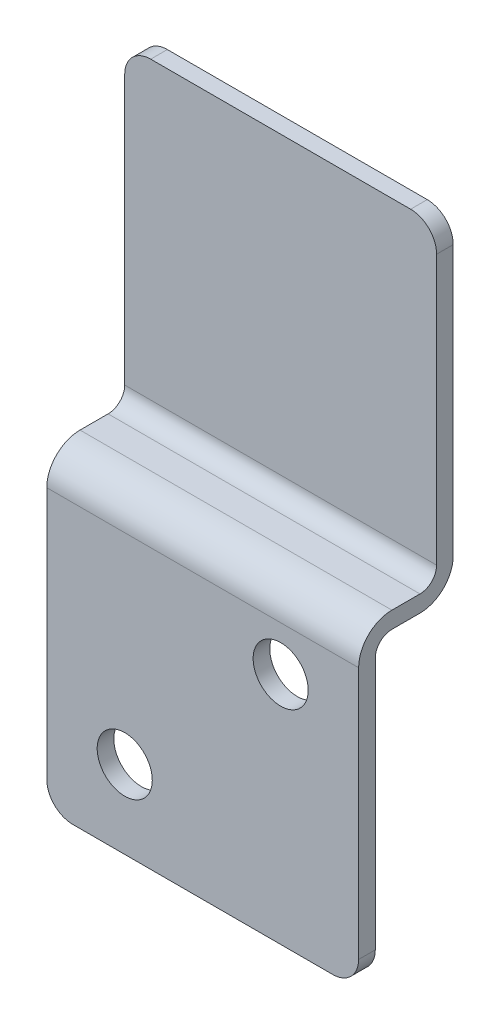
ISO-10303-21;
HEADER;
FILE_DESCRIPTION(('STEP AP214'),'2;1');
FILE_NAME('part.step','',(''),(''),'','','');
FILE_SCHEMA(('AUTOMOTIVE_DESIGN { 1 0 10303 214 1 1 1 1 }'));
ENDSEC;
DATA;
#1=APPLICATION_CONTEXT('core data for automotive mechanical design processes');
#2=APPLICATION_PROTOCOL_DEFINITION('international standard','automotive_design',2000,#1);
#3=PRODUCT_CONTEXT('',#1,'mechanical');
#4=PRODUCT('Part','Part','',(#3));
#5=PRODUCT_RELATED_PRODUCT_CATEGORY('part','',(#4));
#6=PRODUCT_DEFINITION_FORMATION('','',#4);
#7=PRODUCT_DEFINITION_CONTEXT('part definition',#1,'design');
#8=PRODUCT_DEFINITION('design','',#6,#7);
#9=PRODUCT_DEFINITION_SHAPE('','',#8);
#10=(LENGTH_UNIT() NAMED_UNIT(*) SI_UNIT(.MILLI.,.METRE.));
#11=(NAMED_UNIT(*) PLANE_ANGLE_UNIT() SI_UNIT($,.RADIAN.));
#12=(NAMED_UNIT(*) SI_UNIT($,.STERADIAN.) SOLID_ANGLE_UNIT());
#13=UNCERTAINTY_MEASURE_WITH_UNIT(LENGTH_MEASURE(1.E-05),#10,'distance_accuracy_value','');
#14=(GEOMETRIC_REPRESENTATION_CONTEXT(3) GLOBAL_UNCERTAINTY_ASSIGNED_CONTEXT((#13)) GLOBAL_UNIT_ASSIGNED_CONTEXT((#10,
#11,#12)) REPRESENTATION_CONTEXT('',''));
#15=CARTESIAN_POINT('',(0.,0.,0.));
#16=DIRECTION('',(0.,0.,1.));
#17=DIRECTION('',(1.,0.,0.));
#18=AXIS2_PLACEMENT_3D('',#15,#16,#17);
#19=CARTESIAN_POINT('',(38.1,0.,0.));
#20=DIRECTION('',(0.,-1.,0.));
#21=DIRECTION('',(0.,0.,-1.));
#22=AXIS2_PLACEMENT_3D('',#19,#20,#21);
#23=PLANE('',#22);
#24=DIRECTION('',(-1.,0.,0.));
#25=VECTOR('',#24,1.);
#26=CARTESIAN_POINT('',(38.1,0.,-2.032));
#27=LINE('',#26,#25);
#28=CARTESIAN_POINT('',(34.925,0.,-2.032));
#29=VERTEX_POINT('',#28);
#30=CARTESIAN_POINT('',(3.17500000000001,0.,-2.032));
#31=VERTEX_POINT('',#30);
#32=EDGE_CURVE('E188',#29,#31,#27,.T.);
#33=ORIENTED_EDGE('',*,*,#32,.T.);
#34=DIRECTION('',(0.,0.,1.));
#35=VECTOR('',#34,1.);
#36=CARTESIAN_POINT('',(3.175,0.,0.));
#37=LINE('',#36,#35);
#38=CARTESIAN_POINT('',(3.17500000000001,0.,0.));
#39=VERTEX_POINT('',#38);
#40=EDGE_CURVE('E248',#31,#39,#37,.T.);
#41=ORIENTED_EDGE('',*,*,#40,.T.);
#42=DIRECTION('',(-1.,0.,0.));
#43=VECTOR('',#42,1.);
#44=CARTESIAN_POINT('',(38.1,0.,0.));
#45=LINE('',#44,#43);
#46=CARTESIAN_POINT('',(34.925,0.,0.));
#47=VERTEX_POINT('',#46);
#48=EDGE_CURVE('E173',#47,#39,#45,.T.);
#49=ORIENTED_EDGE('',*,*,#48,.F.);
#50=DIRECTION('',(0.,0.,1.));
#51=VECTOR('',#50,1.);
#52=CARTESIAN_POINT('',(34.925,0.,0.));
#53=LINE('',#52,#51);
#54=EDGE_CURVE('E246',#47,#29,#53,.F.);
#55=ORIENTED_EDGE('',*,*,#54,.T.);
#56=EDGE_LOOP('',(#33,#41,#49,#55));
#57=FACE_BOUND('',#56,.T.);
#58=ADVANCED_FACE('F33',(#57),#23,.F.);
#59=CARTESIAN_POINT('',(38.1,0.,0.));
#60=DIRECTION('',(0.,0.,-1.));
#61=DIRECTION('',(0.,1.,0.));
#62=AXIS2_PLACEMENT_3D('',#59,#60,#61);
#63=PLANE('',#62);
#64=ORIENTED_EDGE('',*,*,#48,.T.);
#65=CARTESIAN_POINT('',(3.175,-3.175,0.));
#66=DIRECTION('',(0.,0.,-1.));
#67=DIRECTION('',(0.,1.,0.));
#68=AXIS2_PLACEMENT_3D('',#65,#66,#67);
#69=CIRCLE('',#68,3.175);
#70=CARTESIAN_POINT('',(0.,-3.175,0.));
#71=VERTEX_POINT('',#70);
#72=EDGE_CURVE('E252',#39,#71,#69,.F.);
#73=ORIENTED_EDGE('',*,*,#72,.T.);
#74=DIRECTION('',(0.,-1.,0.));
#75=VECTOR('',#74,1.);
#76=CARTESIAN_POINT('',(0.,0.,0.));
#77=LINE('',#76,#75);
#78=CARTESIAN_POINT('',(0.,-36.068,0.));
#79=VERTEX_POINT('',#78);
#80=EDGE_CURVE('E263',#71,#79,#77,.T.);
#81=ORIENTED_EDGE('',*,*,#80,.T.);
#82=DIRECTION('',(-1.,0.,0.));
#83=VECTOR('',#82,1.);
#84=CARTESIAN_POINT('',(38.1,-36.068,0.));
#85=LINE('',#84,#83);
#86=CARTESIAN_POINT('',(38.1,-36.068,0.));
#87=VERTEX_POINT('',#86);
#88=EDGE_CURVE('E163',#79,#87,#85,.F.);
#89=ORIENTED_EDGE('',*,*,#88,.T.);
#90=DIRECTION('',(0.,-1.,0.));
#91=VECTOR('',#90,1.);
#92=CARTESIAN_POINT('',(38.1,0.,0.));
#93=LINE('',#92,#91);
#94=CARTESIAN_POINT('',(38.1,-3.175,0.));
#95=VERTEX_POINT('',#94);
#96=EDGE_CURVE('E182',#95,#87,#93,.T.);
#97=ORIENTED_EDGE('',*,*,#96,.F.);
#98=CARTESIAN_POINT('',(34.925,-3.175,0.));
#99=DIRECTION('',(0.,0.,-1.));
#100=DIRECTION('',(0.,1.,0.));
#101=AXIS2_PLACEMENT_3D('',#98,#99,#100);
#102=CIRCLE('',#101,3.175);
#103=EDGE_CURVE('E58',#95,#47,#102,.F.);
#104=ORIENTED_EDGE('',*,*,#103,.T.);
#105=EDGE_LOOP('',(#64,#73,#81,#89,#97,#104));
#106=FACE_BOUND('',#105,.T.);
#107=ADVANCED_FACE('F335',(#106),#63,.F.);
#108=CARTESIAN_POINT('',(38.1,-38.1,0.));
#109=DIRECTION('',(0.,-1.,0.));
#110=DIRECTION('',(0.,0.,-1.));
#111=AXIS2_PLACEMENT_3D('',#108,#109,#110);
#112=PLANE('',#111);
#113=DIRECTION('',(0.,0.,1.));
#114=VECTOR('',#113,1.);
#115=CARTESIAN_POINT('',(0.,-38.1,0.));
#116=LINE('',#115,#114);
#117=CARTESIAN_POINT('',(0.,-38.1,2.032));
#118=VERTEX_POINT('',#117);
#119=CARTESIAN_POINT('',(0.,-38.1,5.461));
#120=VERTEX_POINT('',#119);
#121=EDGE_CURVE('E284',#118,#120,#116,.T.);
#122=ORIENTED_EDGE('',*,*,#121,.T.);
#123=DIRECTION('',(-1.,0.,0.));
#124=VECTOR('',#123,1.);
#125=CARTESIAN_POINT('',(38.1,-38.1,5.461));
#126=LINE('',#125,#124);
#127=CARTESIAN_POINT('',(38.1,-38.1,5.461));
#128=VERTEX_POINT('',#127);
#129=EDGE_CURVE('E218',#120,#128,#126,.F.);
#130=ORIENTED_EDGE('',*,*,#129,.T.);
#131=DIRECTION('',(0.,0.,1.));
#132=VECTOR('',#131,1.);
#133=CARTESIAN_POINT('',(38.1,-38.1,0.));
#134=LINE('',#133,#132);
#135=CARTESIAN_POINT('',(38.1,-38.1,2.032));
#136=VERTEX_POINT('',#135);
#137=EDGE_CURVE('E273',#136,#128,#134,.T.);
#138=ORIENTED_EDGE('',*,*,#137,.F.);
#139=DIRECTION('',(-1.,0.,0.));
#140=VECTOR('',#139,1.);
#141=CARTESIAN_POINT('',(0.,-38.1,2.032));
#142=LINE('',#141,#140);
#143=EDGE_CURVE('E201',#136,#118,#142,.T.);
#144=ORIENTED_EDGE('',*,*,#143,.T.);
#145=EDGE_LOOP('',(#122,#130,#138,#144));
#146=FACE_BOUND('',#145,.T.);
#147=ADVANCED_FACE('F317',(#146),#112,.F.);
#148=CARTESIAN_POINT('',(38.1,-38.1,9.525));
#149=DIRECTION('',(0.,0.,-1.));
#150=DIRECTION('',(0.,1.,0.));
#151=AXIS2_PLACEMENT_3D('',#148,#149,#150);
#152=PLANE('',#151);
#153=CARTESIAN_POINT('',(9.525,-66.675,9.52500000000001));
#154=DIRECTION('',(0.,0.,1.));
#155=DIRECTION('',(1.,0.,0.));
#156=AXIS2_PLACEMENT_3D('',#153,#154,#155);
#157=CIRCLE('',#156,3.3655);
#158=CARTESIAN_POINT('',(12.8905,-66.675,9.52500000000001));
#159=VERTEX_POINT('',#158);
#160=EDGE_CURVE('E259',#159,#159,#157,.T.);
#161=ORIENTED_EDGE('',*,*,#160,.F.);
#162=EDGE_LOOP('',(#161));
#163=FACE_BOUND('',#162,.T.);
#164=CARTESIAN_POINT('',(28.575,-47.625,9.52500000000001));
#165=DIRECTION('',(0.,0.,1.));
#166=DIRECTION('',(1.,0.,0.));
#167=AXIS2_PLACEMENT_3D('',#164,#165,#166);
#168=CIRCLE('',#167,3.36549999999999);
#169=CARTESIAN_POINT('',(31.9405,-47.625,9.52500000000001));
#170=VERTEX_POINT('',#169);
#171=EDGE_CURVE('E265',#170,#170,#168,.T.);
#172=ORIENTED_EDGE('',*,*,#171,.F.);
#173=EDGE_LOOP('',(#172));
#174=FACE_BOUND('',#173,.T.);
#175=DIRECTION('',(0.,-1.,0.));
#176=VECTOR('',#175,1.);
#177=CARTESIAN_POINT('',(0.,-38.1,9.525));
#178=LINE('',#177,#176);
#179=CARTESIAN_POINT('',(0.,-42.164,9.525));
#180=VERTEX_POINT('',#179);
#181=CARTESIAN_POINT('',(0.,-73.025,9.52499999999999));
#182=VERTEX_POINT('',#181);
#183=EDGE_CURVE('E184',#180,#182,#178,.T.);
#184=ORIENTED_EDGE('',*,*,#183,.T.);
#185=CARTESIAN_POINT('',(3.175,-73.025,9.52499999999999));
#186=DIRECTION('',(0.,0.,-1.));
#187=DIRECTION('',(0.,1.,0.));
#188=AXIS2_PLACEMENT_3D('',#185,#186,#187);
#189=CIRCLE('',#188,3.175);
#190=CARTESIAN_POINT('',(3.17500000000001,-76.2,9.52499999999999));
#191=VERTEX_POINT('',#190);
#192=EDGE_CURVE('E244',#182,#191,#189,.F.);
#193=ORIENTED_EDGE('',*,*,#192,.T.);
#194=DIRECTION('',(-1.,0.,0.));
#195=VECTOR('',#194,1.);
#196=CARTESIAN_POINT('',(38.1,-76.2,9.52499999999999));
#197=LINE('',#196,#195);
#198=CARTESIAN_POINT('',(34.925,-76.2,9.52499999999999));
#199=VERTEX_POINT('',#198);
#200=EDGE_CURVE('E195',#199,#191,#197,.T.);
#201=ORIENTED_EDGE('',*,*,#200,.F.);
#202=CARTESIAN_POINT('',(34.925,-73.025,9.52499999999999));
#203=DIRECTION('',(0.,0.,-1.));
#204=DIRECTION('',(0.,1.,0.));
#205=AXIS2_PLACEMENT_3D('',#202,#203,#204);
#206=CIRCLE('',#205,3.175);
#207=CARTESIAN_POINT('',(38.1,-73.025,9.52499999999999));
#208=VERTEX_POINT('',#207);
#209=EDGE_CURVE('E242',#199,#208,#206,.F.);
#210=ORIENTED_EDGE('',*,*,#209,.T.);
#211=DIRECTION('',(0.,-1.,0.));
#212=VECTOR('',#211,1.);
#213=CARTESIAN_POINT('',(38.1,-38.1,9.525));
#214=LINE('',#213,#212);
#215=CARTESIAN_POINT('',(38.1,-42.164,9.525));
#216=VERTEX_POINT('',#215);
#217=EDGE_CURVE('E276',#216,#208,#214,.T.);
#218=ORIENTED_EDGE('',*,*,#217,.F.);
#219=DIRECTION('',(-1.,0.,0.));
#220=VECTOR('',#219,1.);
#221=CARTESIAN_POINT('',(38.1,-42.164,9.525));
#222=LINE('',#221,#220);
#223=EDGE_CURVE('E212',#216,#180,#222,.T.);
#224=ORIENTED_EDGE('',*,*,#223,.T.);
#225=EDGE_LOOP('',(#184,#193,#201,#210,#218,#224));
#226=FACE_BOUND('',#225,.T.);
#227=ADVANCED_FACE('F290',(#163,#174,#226),#152,.F.);
#228=CARTESIAN_POINT('',(38.1,-76.2,9.52499999999999));
#229=DIRECTION('',(0.,1.,0.));
#230=DIRECTION('',(0.,0.,1.));
#231=AXIS2_PLACEMENT_3D('',#228,#229,#230);
#232=PLANE('',#231);
#233=ORIENTED_EDGE('',*,*,#200,.T.);
#234=DIRECTION('',(0.,0.,-1.));
#235=VECTOR('',#234,1.);
#236=CARTESIAN_POINT('',(3.175,-76.2,7.49299999999999));
#237=LINE('',#236,#235);
#238=CARTESIAN_POINT('',(3.17500000000001,-76.2,7.49299999999999));
#239=VERTEX_POINT('',#238);
#240=EDGE_CURVE('E231',#191,#239,#237,.T.);
#241=ORIENTED_EDGE('',*,*,#240,.T.);
#242=DIRECTION('',(-1.,0.,0.));
#243=VECTOR('',#242,1.);
#244=CARTESIAN_POINT('',(38.1,-76.2,7.49299999999999));
#245=LINE('',#244,#243);
#246=CARTESIAN_POINT('',(34.925,-76.2,7.49299999999999));
#247=VERTEX_POINT('',#246);
#248=EDGE_CURVE('E191',#247,#239,#245,.T.);
#249=ORIENTED_EDGE('',*,*,#248,.F.);
#250=DIRECTION('',(0.,0.,-1.));
#251=VECTOR('',#250,1.);
#252=CARTESIAN_POINT('',(34.925,-76.2,9.52499999999999));
#253=LINE('',#252,#251);
#254=EDGE_CURVE('E229',#247,#199,#253,.F.);
#255=ORIENTED_EDGE('',*,*,#254,.T.);
#256=EDGE_LOOP('',(#233,#241,#249,#255));
#257=FACE_BOUND('',#256,.T.);
#258=ADVANCED_FACE('F300',(#257),#232,.F.);
#259=CARTESIAN_POINT('',(38.1,-40.132,7.493));
#260=DIRECTION('',(0.,0.,1.));
#261=DIRECTION('',(0.,-1.,0.));
#262=AXIS2_PLACEMENT_3D('',#259,#260,#261);
#263=PLANE('',#262);
#264=CARTESIAN_POINT('',(9.525,-66.675,7.49299999999999));
#265=DIRECTION('',(0.,0.,1.));
#266=DIRECTION('',(0.,-1.,0.));
#267=AXIS2_PLACEMENT_3D('',#264,#265,#266);
#268=CIRCLE('',#267,3.3655);
#269=CARTESIAN_POINT('',(9.525,-70.0405,7.49299999999999));
#270=VERTEX_POINT('',#269);
#271=EDGE_CURVE('E37',#270,#270,#268,.T.);
#272=ORIENTED_EDGE('',*,*,#271,.T.);
#273=EDGE_LOOP('',(#272));
#274=FACE_BOUND('',#273,.T.);
#275=CARTESIAN_POINT('',(28.575,-47.625,7.493));
#276=DIRECTION('',(0.,0.,1.));
#277=DIRECTION('',(0.,-1.,0.));
#278=AXIS2_PLACEMENT_3D('',#275,#276,#277);
#279=CIRCLE('',#278,3.36549999999999);
#280=CARTESIAN_POINT('',(28.575,-50.9905,7.493));
#281=VERTEX_POINT('',#280);
#282=EDGE_CURVE('E257',#281,#281,#279,.T.);
#283=ORIENTED_EDGE('',*,*,#282,.T.);
#284=EDGE_LOOP('',(#283));
#285=FACE_BOUND('',#284,.T.);
#286=ORIENTED_EDGE('',*,*,#248,.T.);
#287=CARTESIAN_POINT('',(3.175,-73.025,7.49299999999999));
#288=DIRECTION('',(0.,0.,1.));
#289=DIRECTION('',(0.,-1.,0.));
#290=AXIS2_PLACEMENT_3D('',#287,#288,#289);
#291=CIRCLE('',#290,3.175);
#292=CARTESIAN_POINT('',(0.,-73.025,7.49299999999999));
#293=VERTEX_POINT('',#292);
#294=EDGE_CURVE('E236',#239,#293,#291,.F.);
#295=ORIENTED_EDGE('',*,*,#294,.T.);
#296=DIRECTION('',(0.,1.,0.));
#297=VECTOR('',#296,1.);
#298=CARTESIAN_POINT('',(0.,-40.132,7.493));
#299=LINE('',#298,#297);
#300=CARTESIAN_POINT('',(0.,-42.164,7.493));
#301=VERTEX_POINT('',#300);
#302=EDGE_CURVE('E179',#293,#301,#299,.T.);
#303=ORIENTED_EDGE('',*,*,#302,.T.);
#304=DIRECTION('',(-1.,0.,0.));
#305=VECTOR('',#304,1.);
#306=CARTESIAN_POINT('',(38.1,-42.164,7.493));
#307=LINE('',#306,#305);
#308=CARTESIAN_POINT('',(38.1,-42.164,7.493));
#309=VERTEX_POINT('',#308);
#310=EDGE_CURVE('E158',#301,#309,#307,.F.);
#311=ORIENTED_EDGE('',*,*,#310,.T.);
#312=DIRECTION('',(0.,1.,0.));
#313=VECTOR('',#312,1.);
#314=CARTESIAN_POINT('',(38.1,-40.132,7.493));
#315=LINE('',#314,#313);
#316=CARTESIAN_POINT('',(38.1,-73.025,7.49299999999999));
#317=VERTEX_POINT('',#316);
#318=EDGE_CURVE('E279',#317,#309,#315,.T.);
#319=ORIENTED_EDGE('',*,*,#318,.F.);
#320=CARTESIAN_POINT('',(34.925,-73.025,7.49299999999999));
#321=DIRECTION('',(0.,0.,1.));
#322=DIRECTION('',(0.,-1.,0.));
#323=AXIS2_PLACEMENT_3D('',#320,#321,#322);
#324=CIRCLE('',#323,3.175);
#325=EDGE_CURVE('E234',#317,#247,#324,.F.);
#326=ORIENTED_EDGE('',*,*,#325,.T.);
#327=EDGE_LOOP('',(#286,#295,#303,#311,#319,#326));
#328=FACE_BOUND('',#327,.T.);
#329=ADVANCED_FACE('F303',(#274,#285,#328),#263,.F.);
#330=CARTESIAN_POINT('',(38.1,-40.132,-2.032));
#331=DIRECTION('',(0.,1.,0.));
#332=DIRECTION('',(0.,0.,1.));
#333=AXIS2_PLACEMENT_3D('',#330,#331,#332);
#334=PLANE('',#333);
#335=DIRECTION('',(0.,0.,-1.));
#336=VECTOR('',#335,1.);
#337=CARTESIAN_POINT('',(0.,-40.132,-2.032));
#338=LINE('',#337,#336);
#339=CARTESIAN_POINT('',(0.,-40.132,5.461));
#340=VERTEX_POINT('',#339);
#341=CARTESIAN_POINT('',(0.,-40.132,2.032));
#342=VERTEX_POINT('',#341);
#343=EDGE_CURVE('E169',#340,#342,#338,.T.);
#344=ORIENTED_EDGE('',*,*,#343,.T.);
#345=DIRECTION('',(-1.,0.,0.));
#346=VECTOR('',#345,1.);
#347=CARTESIAN_POINT('',(38.1,-40.132,2.032));
#348=LINE('',#347,#346);
#349=CARTESIAN_POINT('',(38.1,-40.132,2.032));
#350=VERTEX_POINT('',#349);
#351=EDGE_CURVE('E227',#342,#350,#348,.F.);
#352=ORIENTED_EDGE('',*,*,#351,.T.);
#353=DIRECTION('',(0.,0.,-1.));
#354=VECTOR('',#353,1.);
#355=CARTESIAN_POINT('',(38.1,-40.132,-2.032));
#356=LINE('',#355,#354);
#357=CARTESIAN_POINT('',(38.1,-40.132,5.461));
#358=VERTEX_POINT('',#357);
#359=EDGE_CURVE('E172',#358,#350,#356,.T.);
#360=ORIENTED_EDGE('',*,*,#359,.F.);
#361=DIRECTION('',(-1.,0.,0.));
#362=VECTOR('',#361,1.);
#363=CARTESIAN_POINT('',(0.,-40.132,5.461));
#364=LINE('',#363,#362);
#365=EDGE_CURVE('E156',#358,#340,#364,.T.);
#366=ORIENTED_EDGE('',*,*,#365,.T.);
#367=EDGE_LOOP('',(#344,#352,#360,#366));
#368=FACE_BOUND('',#367,.T.);
#369=ADVANCED_FACE('F168',(#368),#334,.F.);
#370=CARTESIAN_POINT('',(38.1,0.,-2.032));
#371=DIRECTION('',(0.,0.,1.));
#372=DIRECTION('',(0.,-1.,0.));
#373=AXIS2_PLACEMENT_3D('',#370,#371,#372);
#374=PLANE('',#373);
#375=DIRECTION('',(0.,1.,0.));
#376=VECTOR('',#375,1.);
#377=CARTESIAN_POINT('',(0.,0.,-2.032));
#378=LINE('',#377,#376);
#379=CARTESIAN_POINT('',(0.,-36.068,-2.032));
#380=VERTEX_POINT('',#379);
#381=CARTESIAN_POINT('',(0.,-3.175,-2.032));
#382=VERTEX_POINT('',#381);
#383=EDGE_CURVE('E178',#380,#382,#378,.T.);
#384=ORIENTED_EDGE('',*,*,#383,.T.);
#385=CARTESIAN_POINT('',(3.175,-3.175,-2.032));
#386=DIRECTION('',(0.,0.,1.));
#387=DIRECTION('',(0.,-1.,0.));
#388=AXIS2_PLACEMENT_3D('',#385,#386,#387);
#389=CIRCLE('',#388,3.175);
#390=EDGE_CURVE('E255',#382,#31,#389,.F.);
#391=ORIENTED_EDGE('',*,*,#390,.T.);
#392=ORIENTED_EDGE('',*,*,#32,.F.);
#393=CARTESIAN_POINT('',(34.925,-3.175,-2.032));
#394=DIRECTION('',(0.,0.,1.));
#395=DIRECTION('',(0.,-1.,0.));
#396=AXIS2_PLACEMENT_3D('',#393,#394,#395);
#397=CIRCLE('',#396,3.175);
#398=CARTESIAN_POINT('',(38.1,-3.175,-2.032));
#399=VERTEX_POINT('',#398);
#400=EDGE_CURVE('E50',#29,#399,#397,.F.);
#401=ORIENTED_EDGE('',*,*,#400,.T.);
#402=DIRECTION('',(0.,1.,0.));
#403=VECTOR('',#402,1.);
#404=CARTESIAN_POINT('',(38.1,0.,-2.032));
#405=LINE('',#404,#403);
#406=CARTESIAN_POINT('',(38.1,-36.068,-2.032));
#407=VERTEX_POINT('',#406);
#408=EDGE_CURVE('E192',#407,#399,#405,.T.);
#409=ORIENTED_EDGE('',*,*,#408,.F.);
#410=DIRECTION('',(-1.,0.,0.));
#411=VECTOR('',#410,1.);
#412=CARTESIAN_POINT('',(38.1,-36.068,-2.032));
#413=LINE('',#412,#411);
#414=EDGE_CURVE('E224',#407,#380,#413,.T.);
#415=ORIENTED_EDGE('',*,*,#414,.T.);
#416=EDGE_LOOP('',(#384,#391,#392,#401,#409,#415));
#417=FACE_BOUND('',#416,.T.);
#418=ADVANCED_FACE('F331',(#417),#374,.F.);
#419=CARTESIAN_POINT('',(38.1,0.,0.));
#420=DIRECTION('',(-1.,0.,0.));
#421=DIRECTION('',(0.,0.,1.));
#422=AXIS2_PLACEMENT_3D('',#419,#420,#421);
#423=PLANE('',#422);
#424=ORIENTED_EDGE('',*,*,#217,.T.);
#425=DIRECTION('',(0.,0.,-1.));
#426=VECTOR('',#425,1.);
#427=CARTESIAN_POINT('',(38.1,-73.025,0.));
#428=LINE('',#427,#426);
#429=EDGE_CURVE('E11',#208,#317,#428,.T.);
#430=ORIENTED_EDGE('',*,*,#429,.T.);
#431=ORIENTED_EDGE('',*,*,#318,.T.);
#432=CARTESIAN_POINT('',(38.1,-42.164,5.461));
#433=DIRECTION('',(-1.,0.,0.));
#434=DIRECTION('',(0.,0.,1.));
#435=AXIS2_PLACEMENT_3D('',#432,#433,#434);
#436=CIRCLE('',#435,2.032);
#437=EDGE_CURVE('E162',#309,#358,#436,.T.);
#438=ORIENTED_EDGE('',*,*,#437,.T.);
#439=ORIENTED_EDGE('',*,*,#359,.T.);
#440=CARTESIAN_POINT('',(38.1,-36.068,2.03199999999999));
#441=DIRECTION('',(-1.,0.,0.));
#442=DIRECTION('',(0.,0.,1.));
#443=AXIS2_PLACEMENT_3D('',#440,#441,#442);
#444=CIRCLE('',#443,4.064);
#445=EDGE_CURVE('E220',#350,#407,#444,.F.);
#446=ORIENTED_EDGE('',*,*,#445,.T.);
#447=ORIENTED_EDGE('',*,*,#408,.T.);
#448=DIRECTION('',(0.,0.,1.));
#449=VECTOR('',#448,1.);
#450=CARTESIAN_POINT('',(38.1,-3.175,0.));
#451=LINE('',#450,#449);
#452=EDGE_CURVE('E42',#399,#95,#451,.T.);
#453=ORIENTED_EDGE('',*,*,#452,.T.);
#454=ORIENTED_EDGE('',*,*,#96,.T.);
#455=CARTESIAN_POINT('',(38.1,-36.068,2.032));
#456=DIRECTION('',(-1.,0.,0.));
#457=DIRECTION('',(0.,0.,1.));
#458=AXIS2_PLACEMENT_3D('',#455,#456,#457);
#459=CIRCLE('',#458,2.032);
#460=EDGE_CURVE('E210',#87,#136,#459,.T.);
#461=ORIENTED_EDGE('',*,*,#460,.T.);
#462=ORIENTED_EDGE('',*,*,#137,.T.);
#463=CARTESIAN_POINT('',(38.1,-42.164,5.461));
#464=DIRECTION('',(-1.,0.,0.));
#465=DIRECTION('',(0.,0.,1.));
#466=AXIS2_PLACEMENT_3D('',#463,#464,#465);
#467=CIRCLE('',#466,4.064);
#468=EDGE_CURVE('E222',#128,#216,#467,.F.);
#469=ORIENTED_EDGE('',*,*,#468,.T.);
#470=EDGE_LOOP('',(#424,#430,#431,#438,#439,#446,#447,#453,#454,#461,#462,#469));
#471=FACE_BOUND('',#470,.T.);
#472=ADVANCED_FACE('F310',(#471),#423,.F.);
#473=CARTESIAN_POINT('',(0.,0.,0.));
#474=DIRECTION('',(-1.,0.,0.));
#475=DIRECTION('',(0.,0.,1.));
#476=AXIS2_PLACEMENT_3D('',#473,#474,#475);
#477=PLANE('',#476);
#478=ORIENTED_EDGE('',*,*,#302,.F.);
#479=DIRECTION('',(0.,0.,-1.));
#480=VECTOR('',#479,1.);
#481=CARTESIAN_POINT('',(0.,-73.025,9.52499999999999));
#482=LINE('',#481,#480);
#483=EDGE_CURVE('E240',#293,#182,#482,.F.);
#484=ORIENTED_EDGE('',*,*,#483,.T.);
#485=ORIENTED_EDGE('',*,*,#183,.F.);
#486=CARTESIAN_POINT('',(0.,-42.164,5.461));
#487=DIRECTION('',(-1.,0.,0.));
#488=DIRECTION('',(0.,0.,1.));
#489=AXIS2_PLACEMENT_3D('',#486,#487,#488);
#490=CIRCLE('',#489,4.064);
#491=EDGE_CURVE('E216',#180,#120,#490,.T.);
#492=ORIENTED_EDGE('',*,*,#491,.T.);
#493=ORIENTED_EDGE('',*,*,#121,.F.);
#494=CARTESIAN_POINT('',(0.,-36.068,2.032));
#495=DIRECTION('',(-1.,0.,0.));
#496=DIRECTION('',(0.,0.,1.));
#497=AXIS2_PLACEMENT_3D('',#494,#495,#496);
#498=CIRCLE('',#497,2.032);
#499=EDGE_CURVE('E207',#118,#79,#498,.F.);
#500=ORIENTED_EDGE('',*,*,#499,.T.);
#501=ORIENTED_EDGE('',*,*,#80,.F.);
#502=DIRECTION('',(0.,0.,1.));
#503=VECTOR('',#502,1.);
#504=CARTESIAN_POINT('',(0.,-3.175,-2.032));
#505=LINE('',#504,#503);
#506=EDGE_CURVE('E238',#71,#382,#505,.F.);
#507=ORIENTED_EDGE('',*,*,#506,.T.);
#508=ORIENTED_EDGE('',*,*,#383,.F.);
#509=CARTESIAN_POINT('',(0.,-36.068,2.03199999999999));
#510=DIRECTION('',(-1.,0.,0.));
#511=DIRECTION('',(0.,0.,1.));
#512=AXIS2_PLACEMENT_3D('',#509,#510,#511);
#513=CIRCLE('',#512,4.064);
#514=EDGE_CURVE('E177',#380,#342,#513,.T.);
#515=ORIENTED_EDGE('',*,*,#514,.T.);
#516=ORIENTED_EDGE('',*,*,#343,.F.);
#517=CARTESIAN_POINT('',(0.,-42.164,5.461));
#518=DIRECTION('',(-1.,0.,0.));
#519=DIRECTION('',(0.,0.,1.));
#520=AXIS2_PLACEMENT_3D('',#517,#518,#519);
#521=CIRCLE('',#520,2.032);
#522=EDGE_CURVE('E152',#340,#301,#521,.F.);
#523=ORIENTED_EDGE('',*,*,#522,.T.);
#524=EDGE_LOOP('',(#478,#484,#485,#492,#493,#500,#501,#507,#508,#515,#516,#523));
#525=FACE_BOUND('',#524,.T.);
#526=ADVANCED_FACE('F175',(#525),#477,.T.);
#527=CARTESIAN_POINT('',(38.1,-42.164,5.461));
#528=DIRECTION('',(1.,0.,0.));
#529=DIRECTION('',(0.,0.,-1.));
#530=AXIS2_PLACEMENT_3D('',#527,#528,#529);
#531=CYLINDRICAL_SURFACE('',#530,2.032);
#532=ORIENTED_EDGE('',*,*,#437,.F.);
#533=ORIENTED_EDGE('',*,*,#310,.F.);
#534=ORIENTED_EDGE('',*,*,#522,.F.);
#535=ORIENTED_EDGE('',*,*,#365,.F.);
#536=EDGE_LOOP('',(#532,#533,#534,#535));
#537=FACE_BOUND('',#536,.T.);
#538=ADVANCED_FACE('F155',(#537),#531,.F.);
#539=CARTESIAN_POINT('',(38.1,-36.068,2.032));
#540=DIRECTION('',(1.,0.,0.));
#541=DIRECTION('',(0.,0.,-1.));
#542=AXIS2_PLACEMENT_3D('',#539,#540,#541);
#543=CYLINDRICAL_SURFACE('',#542,2.032);
#544=ORIENTED_EDGE('',*,*,#460,.F.);
#545=ORIENTED_EDGE('',*,*,#88,.F.);
#546=ORIENTED_EDGE('',*,*,#499,.F.);
#547=ORIENTED_EDGE('',*,*,#143,.F.);
#548=EDGE_LOOP('',(#544,#545,#546,#547));
#549=FACE_BOUND('',#548,.T.);
#550=ADVANCED_FACE('F322',(#549),#543,.F.);
#551=CARTESIAN_POINT('',(38.1,-42.164,5.461));
#552=DIRECTION('',(-1.,0.,0.));
#553=DIRECTION('',(0.,0.,1.));
#554=AXIS2_PLACEMENT_3D('',#551,#552,#553);
#555=CYLINDRICAL_SURFACE('',#554,4.064);
#556=ORIENTED_EDGE('',*,*,#468,.F.);
#557=ORIENTED_EDGE('',*,*,#129,.F.);
#558=ORIENTED_EDGE('',*,*,#491,.F.);
#559=ORIENTED_EDGE('',*,*,#223,.F.);
#560=EDGE_LOOP('',(#556,#557,#558,#559));
#561=FACE_BOUND('',#560,.T.);
#562=ADVANCED_FACE('F313',(#561),#555,.T.);
#563=CARTESIAN_POINT('',(38.1,-36.068,2.03199999999999));
#564=DIRECTION('',(-1.,0.,0.));
#565=DIRECTION('',(0.,0.,1.));
#566=AXIS2_PLACEMENT_3D('',#563,#564,#565);
#567=CYLINDRICAL_SURFACE('',#566,4.064);
#568=ORIENTED_EDGE('',*,*,#445,.F.);
#569=ORIENTED_EDGE('',*,*,#351,.F.);
#570=ORIENTED_EDGE('',*,*,#514,.F.);
#571=ORIENTED_EDGE('',*,*,#414,.F.);
#572=EDGE_LOOP('',(#568,#569,#570,#571));
#573=FACE_BOUND('',#572,.T.);
#574=ADVANCED_FACE('F352',(#573),#567,.T.);
#575=CARTESIAN_POINT('',(3.175,-73.025,9.52499999999999));
#576=DIRECTION('',(0.,0.,1.));
#577=DIRECTION('',(1.,0.,0.));
#578=AXIS2_PLACEMENT_3D('',#575,#576,#577);
#579=CYLINDRICAL_SURFACE('',#578,3.175);
#580=ORIENTED_EDGE('',*,*,#192,.F.);
#581=ORIENTED_EDGE('',*,*,#483,.F.);
#582=ORIENTED_EDGE('',*,*,#294,.F.);
#583=ORIENTED_EDGE('',*,*,#240,.F.);
#584=EDGE_LOOP('',(#580,#581,#582,#583));
#585=FACE_BOUND('',#584,.T.);
#586=ADVANCED_FACE('F297',(#585),#579,.T.);
#587=CARTESIAN_POINT('',(3.175,-3.175,0.));
#588=DIRECTION('',(0.,0.,-1.));
#589=DIRECTION('',(-1.,0.,0.));
#590=AXIS2_PLACEMENT_3D('',#587,#588,#589);
#591=CYLINDRICAL_SURFACE('',#590,3.175);
#592=ORIENTED_EDGE('',*,*,#390,.F.);
#593=ORIENTED_EDGE('',*,*,#506,.F.);
#594=ORIENTED_EDGE('',*,*,#72,.F.);
#595=ORIENTED_EDGE('',*,*,#40,.F.);
#596=EDGE_LOOP('',(#592,#593,#594,#595));
#597=FACE_BOUND('',#596,.T.);
#598=ADVANCED_FACE('F329',(#597),#591,.T.);
#599=CARTESIAN_POINT('',(34.925,-73.025,0.));
#600=DIRECTION('',(0.,0.,-1.));
#601=DIRECTION('',(-1.,0.,0.));
#602=AXIS2_PLACEMENT_3D('',#599,#600,#601);
#603=CYLINDRICAL_SURFACE('',#602,3.175);
#604=ORIENTED_EDGE('',*,*,#209,.F.);
#605=ORIENTED_EDGE('',*,*,#254,.F.);
#606=ORIENTED_EDGE('',*,*,#325,.F.);
#607=ORIENTED_EDGE('',*,*,#429,.F.);
#608=EDGE_LOOP('',(#604,#605,#606,#607));
#609=FACE_BOUND('',#608,.T.);
#610=ADVANCED_FACE('F308',(#609),#603,.T.);
#611=CARTESIAN_POINT('',(34.925,-3.175,0.));
#612=DIRECTION('',(0.,0.,1.));
#613=DIRECTION('',(1.,0.,0.));
#614=AXIS2_PLACEMENT_3D('',#611,#612,#613);
#615=CYLINDRICAL_SURFACE('',#614,3.175);
#616=ORIENTED_EDGE('',*,*,#400,.F.);
#617=ORIENTED_EDGE('',*,*,#54,.F.);
#618=ORIENTED_EDGE('',*,*,#103,.F.);
#619=ORIENTED_EDGE('',*,*,#452,.F.);
#620=EDGE_LOOP('',(#616,#617,#618,#619));
#621=FACE_BOUND('',#620,.T.);
#622=ADVANCED_FACE('F35',(#621),#615,.T.);
#623=CARTESIAN_POINT('',(28.575,-47.625,-2.03200000000001));
#624=DIRECTION('',(0.,0.,1.));
#625=DIRECTION('',(1.,0.,0.));
#626=AXIS2_PLACEMENT_3D('',#623,#624,#625);
#627=CYLINDRICAL_SURFACE('',#626,3.36549999999999);
#628=ORIENTED_EDGE('',*,*,#171,.T.);
#629=EDGE_LOOP('',(#628));
#630=FACE_BOUND('',#629,.T.);
#631=ORIENTED_EDGE('',*,*,#282,.F.);
#632=EDGE_LOOP('',(#631));
#633=FACE_BOUND('',#632,.T.);
#634=ADVANCED_FACE('F363',(#630,#633),#627,.F.);
#635=CARTESIAN_POINT('',(9.525,-66.675,-2.03200000000001));
#636=DIRECTION('',(0.,0.,1.));
#637=DIRECTION('',(1.,0.,0.));
#638=AXIS2_PLACEMENT_3D('',#635,#636,#637);
#639=CYLINDRICAL_SURFACE('',#638,3.3655);
#640=ORIENTED_EDGE('',*,*,#160,.T.);
#641=EDGE_LOOP('',(#640));
#642=FACE_BOUND('',#641,.T.);
#643=ORIENTED_EDGE('',*,*,#271,.F.);
#644=EDGE_LOOP('',(#643));
#645=FACE_BOUND('',#644,.T.);
#646=ADVANCED_FACE('F367',(#642,#645),#639,.F.);
#647=CLOSED_SHELL('',(#58,#107,#147,#227,#258,#329,#369,#418,#472,#526,#538,#550,#562,#574,#586,
#598,#610,#622,#634,#646));
#648=MANIFOLD_SOLID_BREP('B2',#647);
#649=ADVANCED_BREP_SHAPE_REPRESENTATION('',(#18,#648),#14);
#650=SHAPE_DEFINITION_REPRESENTATION(#9,#649);
ENDSEC;
END-ISO-10303-21;
